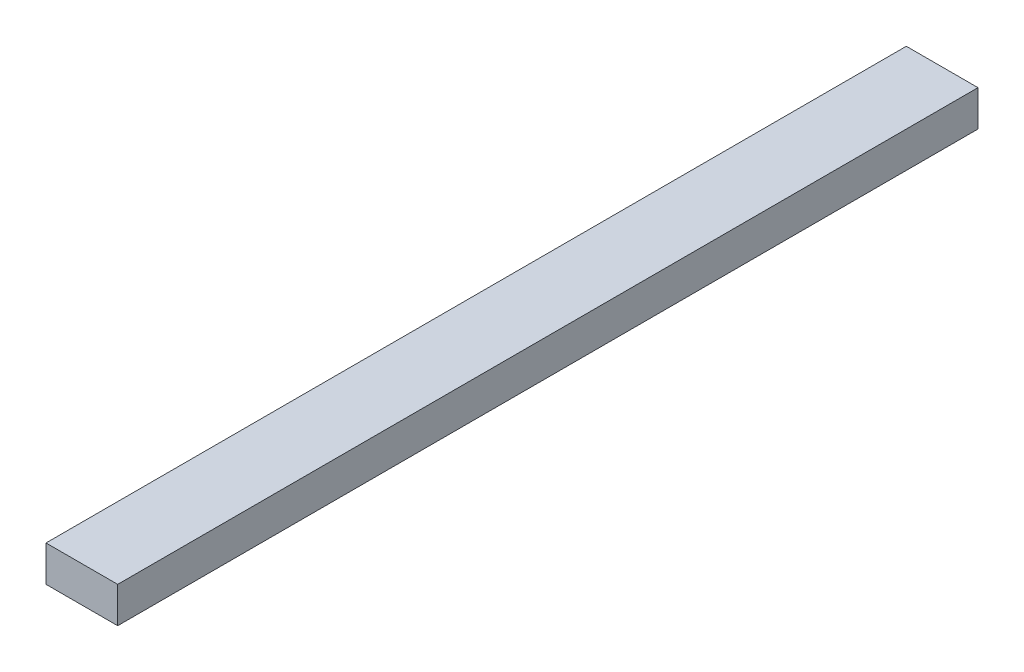
ISO-10303-21;
HEADER;
FILE_DESCRIPTION(('STEP AP214'),'2;1');
FILE_NAME('part.step','',(''),(''),'','','');
FILE_SCHEMA(('AUTOMOTIVE_DESIGN { 1 0 10303 214 1 1 1 1 }'));
ENDSEC;
DATA;
#1=APPLICATION_CONTEXT('core data for automotive mechanical design processes');
#2=APPLICATION_PROTOCOL_DEFINITION('international standard','automotive_design',2000,#1);
#3=PRODUCT_CONTEXT('',#1,'mechanical');
#4=PRODUCT('Part','Part','',(#3));
#5=PRODUCT_RELATED_PRODUCT_CATEGORY('part','',(#4));
#6=PRODUCT_DEFINITION_FORMATION('','',#4);
#7=PRODUCT_DEFINITION_CONTEXT('part definition',#1,'design');
#8=PRODUCT_DEFINITION('design','',#6,#7);
#9=PRODUCT_DEFINITION_SHAPE('','',#8);
#10=(LENGTH_UNIT() NAMED_UNIT(*) SI_UNIT(.MILLI.,.METRE.));
#11=(NAMED_UNIT(*) PLANE_ANGLE_UNIT() SI_UNIT($,.RADIAN.));
#12=(NAMED_UNIT(*) SI_UNIT($,.STERADIAN.) SOLID_ANGLE_UNIT());
#13=UNCERTAINTY_MEASURE_WITH_UNIT(LENGTH_MEASURE(1.E-05),#10,'distance_accuracy_value','');
#14=(GEOMETRIC_REPRESENTATION_CONTEXT(3) GLOBAL_UNCERTAINTY_ASSIGNED_CONTEXT((#13)) GLOBAL_UNIT_ASSIGNED_CONTEXT((#10,
#11,#12)) REPRESENTATION_CONTEXT('',''));
#15=CARTESIAN_POINT('',(0.,0.,0.));
#16=DIRECTION('',(0.,0.,1.));
#17=DIRECTION('',(1.,0.,0.));
#18=AXIS2_PLACEMENT_3D('',#15,#16,#17);
#19=CARTESIAN_POINT('',(0.,0.,609.6));
#20=DIRECTION('',(1.,0.,0.));
#21=DIRECTION('',(0.,1.,0.));
#22=AXIS2_PLACEMENT_3D('',#19,#20,#21);
#23=PLANE('',#22);
#24=DIRECTION('',(0.,-1.,0.));
#25=VECTOR('',#24,1.);
#26=CARTESIAN_POINT('',(0.,0.,0.));
#27=LINE('',#26,#25);
#28=CARTESIAN_POINT('',(0.,25.4,0.));
#29=VERTEX_POINT('',#28);
#30=CARTESIAN_POINT('',(0.,0.,0.));
#31=VERTEX_POINT('',#30);
#32=EDGE_CURVE('E113',#29,#31,#27,.T.);
#33=ORIENTED_EDGE('',*,*,#32,.T.);
#34=DIRECTION('',(0.,0.,-1.));
#35=VECTOR('',#34,1.);
#36=CARTESIAN_POINT('',(0.,0.,609.6));
#37=LINE('',#36,#35);
#38=CARTESIAN_POINT('',(0.,0.,609.6));
#39=VERTEX_POINT('',#38);
#40=EDGE_CURVE('E11',#39,#31,#37,.T.);
#41=ORIENTED_EDGE('',*,*,#40,.F.);
#42=DIRECTION('',(0.,-1.,0.));
#43=VECTOR('',#42,1.);
#44=CARTESIAN_POINT('',(0.,0.,609.6));
#45=LINE('',#44,#43);
#46=CARTESIAN_POINT('',(0.,25.4,609.6));
#47=VERTEX_POINT('',#46);
#48=EDGE_CURVE('E97',#47,#39,#45,.T.);
#49=ORIENTED_EDGE('',*,*,#48,.F.);
#50=DIRECTION('',(0.,0.,-1.));
#51=VECTOR('',#50,1.);
#52=CARTESIAN_POINT('',(0.,25.4,609.6));
#53=LINE('',#52,#51);
#54=EDGE_CURVE('E109',#47,#29,#53,.T.);
#55=ORIENTED_EDGE('',*,*,#54,.T.);
#56=EDGE_LOOP('',(#33,#41,#49,#55));
#57=FACE_BOUND('',#56,.T.);
#58=ADVANCED_FACE('F45',(#57),#23,.F.);
#59=CARTESIAN_POINT('',(0.,0.,609.6));
#60=DIRECTION('',(0.,1.,0.));
#61=DIRECTION('',(0.,0.,1.));
#62=AXIS2_PLACEMENT_3D('',#59,#60,#61);
#63=PLANE('',#62);
#64=DIRECTION('',(1.,0.,0.));
#65=VECTOR('',#64,1.);
#66=CARTESIAN_POINT('',(0.,0.,0.));
#67=LINE('',#66,#65);
#68=CARTESIAN_POINT('',(50.8,0.,0.));
#69=VERTEX_POINT('',#68);
#70=EDGE_CURVE('E102',#31,#69,#67,.T.);
#71=ORIENTED_EDGE('',*,*,#70,.T.);
#72=DIRECTION('',(0.,0.,-1.));
#73=VECTOR('',#72,1.);
#74=CARTESIAN_POINT('',(50.8,0.,609.6));
#75=LINE('',#74,#73);
#76=CARTESIAN_POINT('',(50.8,0.,609.6));
#77=VERTEX_POINT('',#76);
#78=EDGE_CURVE('E54',#77,#69,#75,.T.);
#79=ORIENTED_EDGE('',*,*,#78,.F.);
#80=DIRECTION('',(1.,0.,0.));
#81=VECTOR('',#80,1.);
#82=CARTESIAN_POINT('',(0.,0.,609.6));
#83=LINE('',#82,#81);
#84=EDGE_CURVE('E92',#39,#77,#83,.T.);
#85=ORIENTED_EDGE('',*,*,#84,.F.);
#86=ORIENTED_EDGE('',*,*,#40,.T.);
#87=EDGE_LOOP('',(#71,#79,#85,#86));
#88=FACE_BOUND('',#87,.T.);
#89=ADVANCED_FACE('F101',(#88),#63,.F.);
#90=CARTESIAN_POINT('',(50.8,0.,609.6));
#91=DIRECTION('',(-1.,0.,0.));
#92=DIRECTION('',(0.,-1.,0.));
#93=AXIS2_PLACEMENT_3D('',#90,#91,#92);
#94=PLANE('',#93);
#95=DIRECTION('',(0.,1.,0.));
#96=VECTOR('',#95,1.);
#97=CARTESIAN_POINT('',(50.8,0.,0.));
#98=LINE('',#97,#96);
#99=CARTESIAN_POINT('',(50.8,25.4,0.));
#100=VERTEX_POINT('',#99);
#101=EDGE_CURVE('E79',#69,#100,#98,.T.);
#102=ORIENTED_EDGE('',*,*,#101,.T.);
#103=DIRECTION('',(0.,0.,-1.));
#104=VECTOR('',#103,1.);
#105=CARTESIAN_POINT('',(50.8,25.4,609.6));
#106=LINE('',#105,#104);
#107=CARTESIAN_POINT('',(50.8,25.4,609.6));
#108=VERTEX_POINT('',#107);
#109=EDGE_CURVE('E104',#108,#100,#106,.T.);
#110=ORIENTED_EDGE('',*,*,#109,.F.);
#111=DIRECTION('',(0.,1.,0.));
#112=VECTOR('',#111,1.);
#113=CARTESIAN_POINT('',(50.8,0.,609.6));
#114=LINE('',#113,#112);
#115=EDGE_CURVE('E95',#77,#108,#114,.T.);
#116=ORIENTED_EDGE('',*,*,#115,.F.);
#117=ORIENTED_EDGE('',*,*,#78,.T.);
#118=EDGE_LOOP('',(#102,#110,#116,#117));
#119=FACE_BOUND('',#118,.T.);
#120=ADVANCED_FACE('F105',(#119),#94,.F.);
#121=CARTESIAN_POINT('',(0.,25.4,609.6));
#122=DIRECTION('',(0.,-1.,0.));
#123=DIRECTION('',(0.,0.,-1.));
#124=AXIS2_PLACEMENT_3D('',#121,#122,#123);
#125=PLANE('',#124);
#126=DIRECTION('',(-1.,0.,0.));
#127=VECTOR('',#126,1.);
#128=CARTESIAN_POINT('',(0.,25.4,0.));
#129=LINE('',#128,#127);
#130=EDGE_CURVE('E85',#100,#29,#129,.T.);
#131=ORIENTED_EDGE('',*,*,#130,.T.);
#132=ORIENTED_EDGE('',*,*,#54,.F.);
#133=DIRECTION('',(-1.,0.,0.));
#134=VECTOR('',#133,1.);
#135=CARTESIAN_POINT('',(0.,25.4,609.6));
#136=LINE('',#135,#134);
#137=EDGE_CURVE('E62',#108,#47,#136,.T.);
#138=ORIENTED_EDGE('',*,*,#137,.F.);
#139=ORIENTED_EDGE('',*,*,#109,.T.);
#140=EDGE_LOOP('',(#131,#132,#138,#139));
#141=FACE_BOUND('',#140,.T.);
#142=ADVANCED_FACE('F126',(#141),#125,.F.);
#143=CARTESIAN_POINT('',(0.,0.,609.6));
#144=DIRECTION('',(0.,0.,-1.));
#145=DIRECTION('',(-1.,0.,0.));
#146=AXIS2_PLACEMENT_3D('',#143,#144,#145);
#147=PLANE('',#146);
#148=ORIENTED_EDGE('',*,*,#48,.T.);
#149=ORIENTED_EDGE('',*,*,#84,.T.);
#150=ORIENTED_EDGE('',*,*,#115,.T.);
#151=ORIENTED_EDGE('',*,*,#137,.T.);
#152=EDGE_LOOP('',(#148,#149,#150,#151));
#153=FACE_BOUND('',#152,.T.);
#154=ADVANCED_FACE('F93',(#153),#147,.F.);
#155=CARTESIAN_POINT('',(0.,0.,0.));
#156=DIRECTION('',(0.,0.,-1.));
#157=DIRECTION('',(-1.,0.,0.));
#158=AXIS2_PLACEMENT_3D('',#155,#156,#157);
#159=PLANE('',#158);
#160=ORIENTED_EDGE('',*,*,#32,.F.);
#161=ORIENTED_EDGE('',*,*,#130,.F.);
#162=ORIENTED_EDGE('',*,*,#101,.F.);
#163=ORIENTED_EDGE('',*,*,#70,.F.);
#164=EDGE_LOOP('',(#160,#161,#162,#163));
#165=FACE_BOUND('',#164,.T.);
#166=ADVANCED_FACE('F129',(#165),#159,.T.);
#167=CLOSED_SHELL('',(#58,#89,#120,#142,#154,#166));
#168=MANIFOLD_SOLID_BREP('B2',#167);
#169=ADVANCED_BREP_SHAPE_REPRESENTATION('',(#18,#168),#14);
#170=SHAPE_DEFINITION_REPRESENTATION(#9,#169);
ENDSEC;
END-ISO-10303-21;
